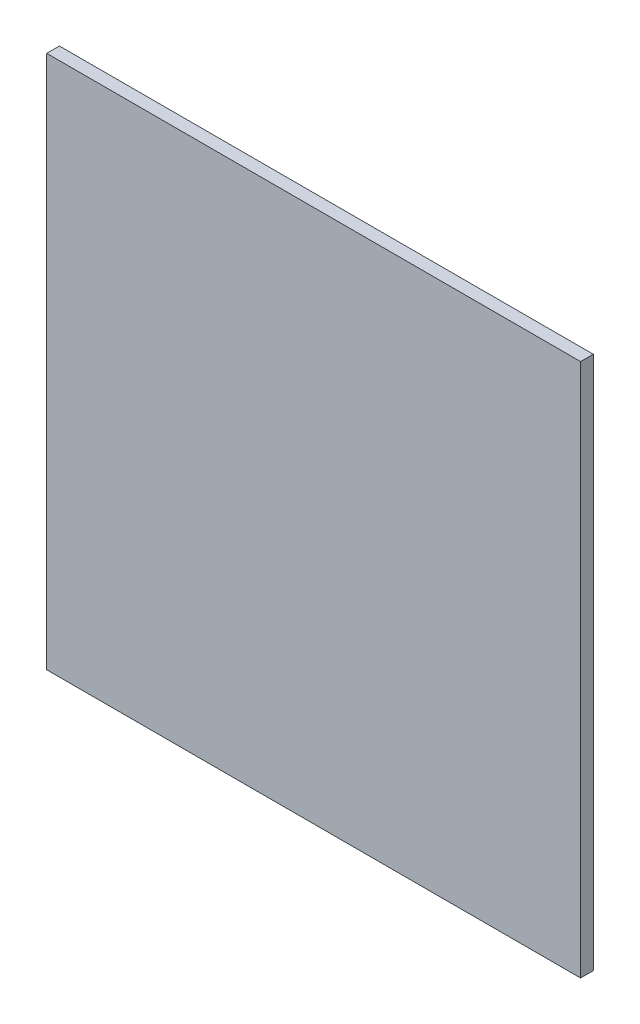
ISO-10303-21;
HEADER;
FILE_DESCRIPTION(('STEP AP214'),'2;1');
FILE_NAME('part.step','',(''),(''),'','','');
FILE_SCHEMA(('AUTOMOTIVE_DESIGN { 1 0 10303 214 1 1 1 1 }'));
ENDSEC;
DATA;
#1=APPLICATION_CONTEXT('core data for automotive mechanical design processes');
#2=APPLICATION_PROTOCOL_DEFINITION('international standard','automotive_design',2000,#1);
#3=PRODUCT_CONTEXT('',#1,'mechanical');
#4=PRODUCT('Part','Part','',(#3));
#5=PRODUCT_RELATED_PRODUCT_CATEGORY('part','',(#4));
#6=PRODUCT_DEFINITION_FORMATION('','',#4);
#7=PRODUCT_DEFINITION_CONTEXT('part definition',#1,'design');
#8=PRODUCT_DEFINITION('design','',#6,#7);
#9=PRODUCT_DEFINITION_SHAPE('','',#8);
#10=(LENGTH_UNIT() NAMED_UNIT(*) SI_UNIT(.MILLI.,.METRE.));
#11=(NAMED_UNIT(*) PLANE_ANGLE_UNIT() SI_UNIT($,.RADIAN.));
#12=(NAMED_UNIT(*) SI_UNIT($,.STERADIAN.) SOLID_ANGLE_UNIT());
#13=UNCERTAINTY_MEASURE_WITH_UNIT(LENGTH_MEASURE(1.E-05),#10,'distance_accuracy_value','');
#14=(GEOMETRIC_REPRESENTATION_CONTEXT(3) GLOBAL_UNCERTAINTY_ASSIGNED_CONTEXT((#13)) GLOBAL_UNIT_ASSIGNED_CONTEXT((#10,
#11,#12)) REPRESENTATION_CONTEXT('',''));
#15=CARTESIAN_POINT('',(0.,0.,0.));
#16=DIRECTION('',(0.,0.,1.));
#17=DIRECTION('',(1.,0.,0.));
#18=AXIS2_PLACEMENT_3D('',#15,#16,#17);
#19=CARTESIAN_POINT('',(-53.34,53.34,2.54));
#20=DIRECTION('',(1.,0.,0.));
#21=DIRECTION('',(0.,1.,0.));
#22=AXIS2_PLACEMENT_3D('',#19,#20,#21);
#23=PLANE('',#22);
#24=DIRECTION('',(0.,-1.,0.));
#25=VECTOR('',#24,1.);
#26=CARTESIAN_POINT('',(-53.34,53.34,0.));
#27=LINE('',#26,#25);
#28=CARTESIAN_POINT('',(-53.34,53.34,0.));
#29=VERTEX_POINT('',#28);
#30=CARTESIAN_POINT('',(-53.3399999999999,-53.34,0.));
#31=VERTEX_POINT('',#30);
#32=EDGE_CURVE('E98',#29,#31,#27,.T.);
#33=ORIENTED_EDGE('',*,*,#32,.T.);
#34=DIRECTION('',(0.,0.,-1.));
#35=VECTOR('',#34,1.);
#36=CARTESIAN_POINT('',(-53.3399999999999,-53.34,2.54));
#37=LINE('',#36,#35);
#38=CARTESIAN_POINT('',(-53.3399999999999,-53.34,2.54));
#39=VERTEX_POINT('',#38);
#40=EDGE_CURVE('E11',#39,#31,#37,.T.);
#41=ORIENTED_EDGE('',*,*,#40,.F.);
#42=DIRECTION('',(0.,-1.,0.));
#43=VECTOR('',#42,1.);
#44=CARTESIAN_POINT('',(-53.34,53.34,2.54));
#45=LINE('',#44,#43);
#46=CARTESIAN_POINT('',(-53.34,53.34,2.54));
#47=VERTEX_POINT('',#46);
#48=EDGE_CURVE('E86',#47,#39,#45,.T.);
#49=ORIENTED_EDGE('',*,*,#48,.F.);
#50=DIRECTION('',(0.,0.,-1.));
#51=VECTOR('',#50,1.);
#52=CARTESIAN_POINT('',(-53.34,53.34,2.54));
#53=LINE('',#52,#51);
#54=EDGE_CURVE('E94',#47,#29,#53,.T.);
#55=ORIENTED_EDGE('',*,*,#54,.T.);
#56=EDGE_LOOP('',(#33,#41,#49,#55));
#57=FACE_BOUND('',#56,.T.);
#58=ADVANCED_FACE('F35',(#57),#23,.F.);
#59=CARTESIAN_POINT('',(53.34,-53.34,2.54));
#60=DIRECTION('',(0.,1.,0.));
#61=DIRECTION('',(-1.,0.,0.));
#62=AXIS2_PLACEMENT_3D('',#59,#60,#61);
#63=PLANE('',#62);
#64=DIRECTION('',(1.,0.,0.));
#65=VECTOR('',#64,1.);
#66=CARTESIAN_POINT('',(53.34,-53.34,0.));
#67=LINE('',#66,#65);
#68=CARTESIAN_POINT('',(53.34,-53.34,0.));
#69=VERTEX_POINT('',#68);
#70=EDGE_CURVE('E90',#31,#69,#67,.T.);
#71=ORIENTED_EDGE('',*,*,#70,.T.);
#72=DIRECTION('',(0.,0.,-1.));
#73=VECTOR('',#72,1.);
#74=CARTESIAN_POINT('',(53.34,-53.34,2.54));
#75=LINE('',#74,#73);
#76=CARTESIAN_POINT('',(53.34,-53.34,2.54));
#77=VERTEX_POINT('',#76);
#78=EDGE_CURVE('E43',#77,#69,#75,.T.);
#79=ORIENTED_EDGE('',*,*,#78,.F.);
#80=DIRECTION('',(1.,0.,0.));
#81=VECTOR('',#80,1.);
#82=CARTESIAN_POINT('',(53.34,-53.34,2.54));
#83=LINE('',#82,#81);
#84=EDGE_CURVE('E81',#39,#77,#83,.T.);
#85=ORIENTED_EDGE('',*,*,#84,.F.);
#86=ORIENTED_EDGE('',*,*,#40,.T.);
#87=EDGE_LOOP('',(#71,#79,#85,#86));
#88=FACE_BOUND('',#87,.T.);
#89=ADVANCED_FACE('F89',(#88),#63,.F.);
#90=CARTESIAN_POINT('',(53.34,53.34,2.54));
#91=DIRECTION('',(-1.,0.,0.));
#92=DIRECTION('',(0.,-1.,0.));
#93=AXIS2_PLACEMENT_3D('',#90,#91,#92);
#94=PLANE('',#93);
#95=DIRECTION('',(0.,1.,0.));
#96=VECTOR('',#95,1.);
#97=CARTESIAN_POINT('',(53.34,53.34,0.));
#98=LINE('',#97,#96);
#99=CARTESIAN_POINT('',(53.34,53.34,0.));
#100=VERTEX_POINT('',#99);
#101=EDGE_CURVE('E68',#69,#100,#98,.T.);
#102=ORIENTED_EDGE('',*,*,#101,.T.);
#103=DIRECTION('',(0.,0.,-1.));
#104=VECTOR('',#103,1.);
#105=CARTESIAN_POINT('',(53.34,53.34,2.54));
#106=LINE('',#105,#104);
#107=CARTESIAN_POINT('',(53.34,53.34,2.54));
#108=VERTEX_POINT('',#107);
#109=EDGE_CURVE('E91',#108,#100,#106,.T.);
#110=ORIENTED_EDGE('',*,*,#109,.F.);
#111=DIRECTION('',(0.,1.,0.));
#112=VECTOR('',#111,1.);
#113=CARTESIAN_POINT('',(53.34,53.34,2.54));
#114=LINE('',#113,#112);
#115=EDGE_CURVE('E84',#77,#108,#114,.T.);
#116=ORIENTED_EDGE('',*,*,#115,.F.);
#117=ORIENTED_EDGE('',*,*,#78,.T.);
#118=EDGE_LOOP('',(#102,#110,#116,#117));
#119=FACE_BOUND('',#118,.T.);
#120=ADVANCED_FACE('F92',(#119),#94,.F.);
#121=CARTESIAN_POINT('',(53.34,53.34,2.54));
#122=DIRECTION('',(0.,-1.,0.));
#123=DIRECTION('',(0.,0.,-1.));
#124=AXIS2_PLACEMENT_3D('',#121,#122,#123);
#125=PLANE('',#124);
#126=DIRECTION('',(-1.,0.,0.));
#127=VECTOR('',#126,1.);
#128=CARTESIAN_POINT('',(53.34,53.34,0.));
#129=LINE('',#128,#127);
#130=EDGE_CURVE('E74',#100,#29,#129,.T.);
#131=ORIENTED_EDGE('',*,*,#130,.T.);
#132=ORIENTED_EDGE('',*,*,#54,.F.);
#133=DIRECTION('',(-1.,0.,0.));
#134=VECTOR('',#133,1.);
#135=CARTESIAN_POINT('',(53.34,53.34,2.54));
#136=LINE('',#135,#134);
#137=EDGE_CURVE('E51',#108,#47,#136,.T.);
#138=ORIENTED_EDGE('',*,*,#137,.F.);
#139=ORIENTED_EDGE('',*,*,#109,.T.);
#140=EDGE_LOOP('',(#131,#132,#138,#139));
#141=FACE_BOUND('',#140,.T.);
#142=ADVANCED_FACE('F105',(#141),#125,.F.);
#143=CARTESIAN_POINT('',(-53.3399999999999,-53.34,2.54));
#144=DIRECTION('',(0.,0.,-1.));
#145=DIRECTION('',(-1.,0.,0.));
#146=AXIS2_PLACEMENT_3D('',#143,#144,#145);
#147=PLANE('',#146);
#148=ORIENTED_EDGE('',*,*,#48,.T.);
#149=ORIENTED_EDGE('',*,*,#84,.T.);
#150=ORIENTED_EDGE('',*,*,#115,.T.);
#151=ORIENTED_EDGE('',*,*,#137,.T.);
#152=EDGE_LOOP('',(#148,#149,#150,#151));
#153=FACE_BOUND('',#152,.T.);
#154=ADVANCED_FACE('F82',(#153),#147,.F.);
#155=CARTESIAN_POINT('',(-53.3399999999999,-53.34,0.));
#156=DIRECTION('',(0.,0.,-1.));
#157=DIRECTION('',(-1.,0.,0.));
#158=AXIS2_PLACEMENT_3D('',#155,#156,#157);
#159=PLANE('',#158);
#160=ORIENTED_EDGE('',*,*,#32,.F.);
#161=ORIENTED_EDGE('',*,*,#130,.F.);
#162=ORIENTED_EDGE('',*,*,#101,.F.);
#163=ORIENTED_EDGE('',*,*,#70,.F.);
#164=EDGE_LOOP('',(#160,#161,#162,#163));
#165=FACE_BOUND('',#164,.T.);
#166=ADVANCED_FACE('F108',(#165),#159,.T.);
#167=CLOSED_SHELL('',(#58,#89,#120,#142,#154,#166));
#168=MANIFOLD_SOLID_BREP('B2',#167);
#169=ADVANCED_BREP_SHAPE_REPRESENTATION('',(#18,#168),#14);
#170=SHAPE_DEFINITION_REPRESENTATION(#9,#169);
ENDSEC;
END-ISO-10303-21;
